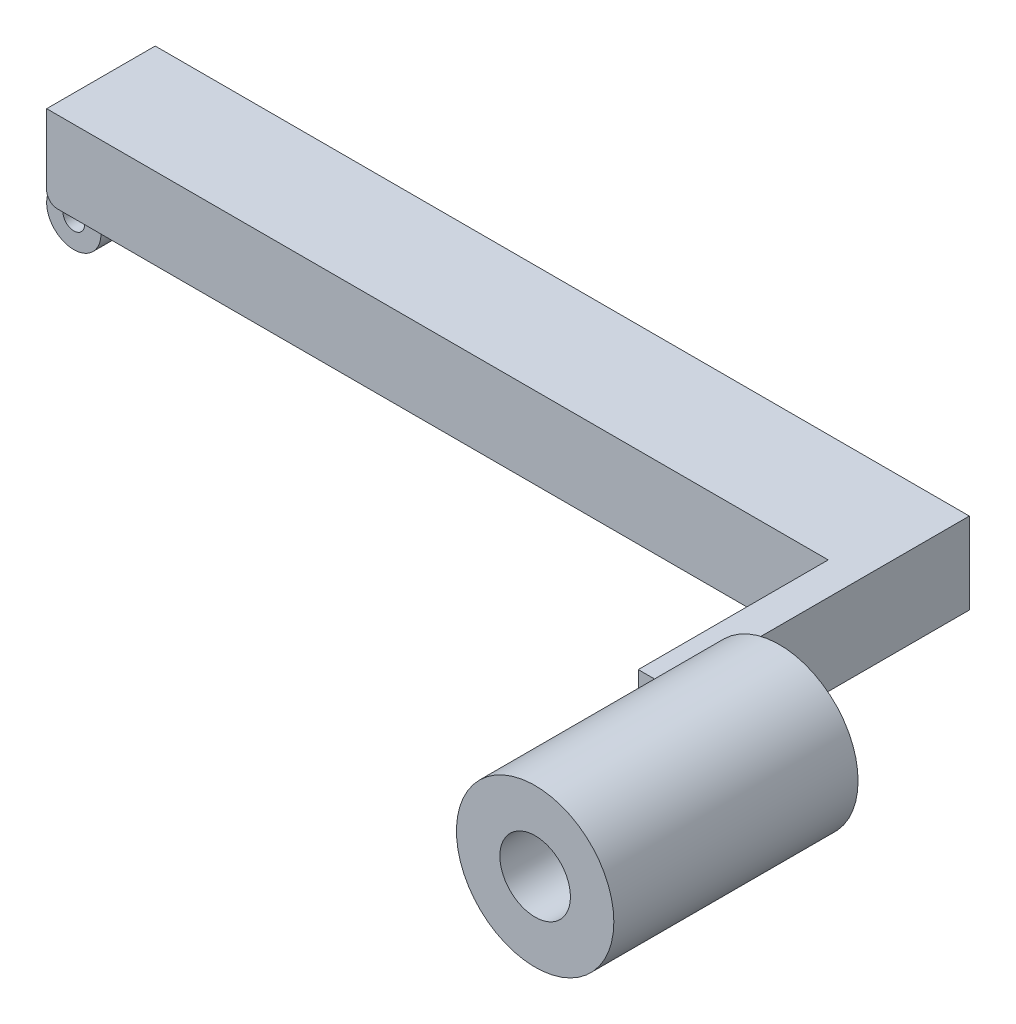
ISO-10303-21;
HEADER;
FILE_DESCRIPTION(('STEP AP214'),'2;1');
FILE_NAME('part.step','',(''),(''),'','','');
FILE_SCHEMA(('AUTOMOTIVE_DESIGN { 1 0 10303 214 1 1 1 1 }'));
ENDSEC;
DATA;
#1=APPLICATION_CONTEXT('core data for automotive mechanical design processes');
#2=APPLICATION_PROTOCOL_DEFINITION('international standard','automotive_design',2000,#1);
#3=PRODUCT_CONTEXT('',#1,'mechanical');
#4=PRODUCT('Part','Part','',(#3));
#5=PRODUCT_RELATED_PRODUCT_CATEGORY('part','',(#4));
#6=PRODUCT_DEFINITION_FORMATION('','',#4);
#7=PRODUCT_DEFINITION_CONTEXT('part definition',#1,'design');
#8=PRODUCT_DEFINITION('design','',#6,#7);
#9=PRODUCT_DEFINITION_SHAPE('','',#8);
#10=(LENGTH_UNIT() NAMED_UNIT(*) SI_UNIT(.MILLI.,.METRE.));
#11=(NAMED_UNIT(*) PLANE_ANGLE_UNIT() SI_UNIT($,.RADIAN.));
#12=(NAMED_UNIT(*) SI_UNIT($,.STERADIAN.) SOLID_ANGLE_UNIT());
#13=UNCERTAINTY_MEASURE_WITH_UNIT(LENGTH_MEASURE(1.E-05),#10,'distance_accuracy_value','');
#14=(GEOMETRIC_REPRESENTATION_CONTEXT(3) GLOBAL_UNCERTAINTY_ASSIGNED_CONTEXT((#13)) GLOBAL_UNIT_ASSIGNED_CONTEXT((#10,
#11,#12)) REPRESENTATION_CONTEXT('',''));
#15=CARTESIAN_POINT('',(0.,0.,0.));
#16=DIRECTION('',(0.,0.,1.));
#17=DIRECTION('',(1.,0.,0.));
#18=AXIS2_PLACEMENT_3D('',#15,#16,#17);
#19=CARTESIAN_POINT('',(150.,7.5,10.));
#20=DIRECTION('',(0.,-1.,0.));
#21=DIRECTION('',(0.,0.,-1.));
#22=AXIS2_PLACEMENT_3D('',#19,#20,#21);
#23=PLANE('',#22);
#24=DIRECTION('',(0.,0.,-1.));
#25=VECTOR('',#24,1.);
#26=CARTESIAN_POINT('',(147.590326354009,7.5,80.));
#27=LINE('',#26,#25);
#28=CARTESIAN_POINT('',(147.590326354009,7.5,35.));
#29=VERTEX_POINT('',#28);
#30=CARTESIAN_POINT('',(147.590326354009,7.5,45.));
#31=VERTEX_POINT('',#30);
#32=EDGE_CURVE('E179',#29,#31,#27,.F.);
#33=ORIENTED_EDGE('',*,*,#32,.F.);
#34=DIRECTION('',(-1.,0.,0.));
#35=VECTOR('',#34,1.);
#36=CARTESIAN_POINT('',(150.,7.5,35.));
#37=LINE('',#36,#35);
#38=CARTESIAN_POINT('',(150.,7.5,35.));
#39=VERTEX_POINT('',#38);
#40=EDGE_CURVE('E185',#39,#29,#37,.T.);
#41=ORIENTED_EDGE('',*,*,#40,.F.);
#42=DIRECTION('',(0.,0.,1.));
#43=VECTOR('',#42,1.);
#44=CARTESIAN_POINT('',(150.,7.5,10.));
#45=LINE('',#44,#43);
#46=CARTESIAN_POINT('',(150.,7.5,-10.));
#47=VERTEX_POINT('',#46);
#48=EDGE_CURVE('E207',#47,#39,#45,.T.);
#49=ORIENTED_EDGE('',*,*,#48,.F.);
#50=DIRECTION('',(-1.,0.,0.));
#51=VECTOR('',#50,1.);
#52=CARTESIAN_POINT('',(150.,7.5,-10.));
#53=LINE('',#52,#51);
#54=CARTESIAN_POINT('',(0.,7.5,-10.));
#55=VERTEX_POINT('',#54);
#56=EDGE_CURVE('E227',#47,#55,#53,.T.);
#57=ORIENTED_EDGE('',*,*,#56,.T.);
#58=DIRECTION('',(0.,0.,1.));
#59=VECTOR('',#58,1.);
#60=CARTESIAN_POINT('',(0.,7.5,10.));
#61=LINE('',#60,#59);
#62=CARTESIAN_POINT('',(0.,7.5,10.));
#63=VERTEX_POINT('',#62);
#64=EDGE_CURVE('E215',#55,#63,#61,.T.);
#65=ORIENTED_EDGE('',*,*,#64,.T.);
#66=DIRECTION('',(-1.,0.,0.));
#67=VECTOR('',#66,1.);
#68=CARTESIAN_POINT('',(150.,7.5,10.));
#69=LINE('',#68,#67);
#70=CARTESIAN_POINT('',(144.,7.5,10.));
#71=VERTEX_POINT('',#70);
#72=EDGE_CURVE('E225',#71,#63,#69,.T.);
#73=ORIENTED_EDGE('',*,*,#72,.F.);
#74=DIRECTION('',(0.,0.,-1.));
#75=VECTOR('',#74,1.);
#76=CARTESIAN_POINT('',(144.,7.5,45.));
#77=LINE('',#76,#75);
#78=CARTESIAN_POINT('',(144.,7.5,45.));
#79=VERTEX_POINT('',#78);
#80=EDGE_CURVE('E200',#79,#71,#77,.T.);
#81=ORIENTED_EDGE('',*,*,#80,.F.);
#82=DIRECTION('',(-1.,0.,0.));
#83=VECTOR('',#82,1.);
#84=CARTESIAN_POINT('',(150.,7.5,45.));
#85=LINE('',#84,#83);
#86=EDGE_CURVE('E189',#31,#79,#85,.T.);
#87=ORIENTED_EDGE('',*,*,#86,.F.);
#88=EDGE_LOOP('',(#33,#41,#49,#57,#65,#73,#81,#87));
#89=FACE_BOUND('',#88,.T.);
#90=ADVANCED_FACE('F37',(#89),#23,.F.);
#91=CARTESIAN_POINT('',(150.,-7.5,10.));
#92=DIRECTION('',(0.,1.,0.));
#93=DIRECTION('',(0.,0.,1.));
#94=AXIS2_PLACEMENT_3D('',#91,#92,#93);
#95=PLANE('',#94);
#96=DIRECTION('',(-1.,0.,0.));
#97=VECTOR('',#96,1.);
#98=CARTESIAN_POINT('',(0.,-7.5,-5.));
#99=LINE('',#98,#97);
#100=CARTESIAN_POINT('',(5.,-7.5,-5.));
#101=VERTEX_POINT('',#100);
#102=CARTESIAN_POINT('',(2.,-7.5,-5.));
#103=VERTEX_POINT('',#102);
#104=EDGE_CURVE('E155',#101,#103,#99,.T.);
#105=ORIENTED_EDGE('',*,*,#104,.T.);
#106=DIRECTION('',(0.,0.,-1.));
#107=VECTOR('',#106,1.);
#108=CARTESIAN_POINT('',(2.,-7.5,-10.));
#109=LINE('',#108,#107);
#110=CARTESIAN_POINT('',(2.,-7.5,-10.));
#111=VERTEX_POINT('',#110);
#112=EDGE_CURVE('E239',#103,#111,#109,.T.);
#113=ORIENTED_EDGE('',*,*,#112,.T.);
#114=DIRECTION('',(-1.,0.,0.));
#115=VECTOR('',#114,1.);
#116=CARTESIAN_POINT('',(150.,-7.5,-10.));
#117=LINE('',#116,#115);
#118=CARTESIAN_POINT('',(150.,-7.5,-10.));
#119=VERTEX_POINT('',#118);
#120=EDGE_CURVE('E213',#119,#111,#117,.T.);
#121=ORIENTED_EDGE('',*,*,#120,.F.);
#122=DIRECTION('',(0.,0.,-1.));
#123=VECTOR('',#122,1.);
#124=CARTESIAN_POINT('',(150.,-7.5,10.));
#125=LINE('',#124,#123);
#126=CARTESIAN_POINT('',(150.,-7.5,35.));
#127=VERTEX_POINT('',#126);
#128=EDGE_CURVE('E211',#127,#119,#125,.T.);
#129=ORIENTED_EDGE('',*,*,#128,.F.);
#130=DIRECTION('',(1.,0.,0.));
#131=VECTOR('',#130,1.);
#132=CARTESIAN_POINT('',(150.,-7.5,35.));
#133=LINE('',#132,#131);
#134=CARTESIAN_POINT('',(147.590326354009,-7.5,35.));
#135=VERTEX_POINT('',#134);
#136=EDGE_CURVE('E182',#135,#127,#133,.T.);
#137=ORIENTED_EDGE('',*,*,#136,.F.);
#138=DIRECTION('',(0.,0.,-1.));
#139=VECTOR('',#138,1.);
#140=CARTESIAN_POINT('',(147.590326354009,-7.5,80.));
#141=LINE('',#140,#139);
#142=CARTESIAN_POINT('',(147.590326354009,-7.5,45.));
#143=VERTEX_POINT('',#142);
#144=EDGE_CURVE('E176',#143,#135,#141,.T.);
#145=ORIENTED_EDGE('',*,*,#144,.F.);
#146=DIRECTION('',(1.,0.,0.));
#147=VECTOR('',#146,1.);
#148=CARTESIAN_POINT('',(150.,-7.5,45.));
#149=LINE('',#148,#147);
#150=CARTESIAN_POINT('',(144.,-7.5,45.));
#151=VERTEX_POINT('',#150);
#152=EDGE_CURVE('E193',#151,#143,#149,.T.);
#153=ORIENTED_EDGE('',*,*,#152,.F.);
#154=DIRECTION('',(0.,0.,-1.));
#155=VECTOR('',#154,1.);
#156=CARTESIAN_POINT('',(144.,-7.5,45.));
#157=LINE('',#156,#155);
#158=CARTESIAN_POINT('',(144.,-7.5,10.));
#159=VERTEX_POINT('',#158);
#160=EDGE_CURVE('E195',#151,#159,#157,.T.);
#161=ORIENTED_EDGE('',*,*,#160,.T.);
#162=DIRECTION('',(-1.,0.,0.));
#163=VECTOR('',#162,1.);
#164=CARTESIAN_POINT('',(150.,-7.5,10.));
#165=LINE('',#164,#163);
#166=CARTESIAN_POINT('',(2.,-7.5,10.));
#167=VERTEX_POINT('',#166);
#168=EDGE_CURVE('E222',#159,#167,#165,.T.);
#169=ORIENTED_EDGE('',*,*,#168,.T.);
#170=DIRECTION('',(0.,0.,-1.));
#171=VECTOR('',#170,1.);
#172=CARTESIAN_POINT('',(2.,-7.5,5.));
#173=LINE('',#172,#171);
#174=CARTESIAN_POINT('',(2.,-7.5,5.));
#175=VERTEX_POINT('',#174);
#176=EDGE_CURVE('E236',#167,#175,#173,.T.);
#177=ORIENTED_EDGE('',*,*,#176,.T.);
#178=DIRECTION('',(-1.,0.,0.));
#179=VECTOR('',#178,1.);
#180=CARTESIAN_POINT('',(0.,-7.5,5.));
#181=LINE('',#180,#179);
#182=CARTESIAN_POINT('',(5.,-7.5,5.));
#183=VERTEX_POINT('',#182);
#184=EDGE_CURVE('E147',#183,#175,#181,.T.);
#185=ORIENTED_EDGE('',*,*,#184,.F.);
#186=DIRECTION('',(0.,0.,-1.));
#187=VECTOR('',#186,1.);
#188=CARTESIAN_POINT('',(5.,-7.5,5.));
#189=LINE('',#188,#187);
#190=EDGE_CURVE('E145',#183,#101,#189,.T.);
#191=ORIENTED_EDGE('',*,*,#190,.T.);
#192=EDGE_LOOP('',(#105,#113,#121,#129,#137,#145,#153,#161,#169,#177,#185,#191));
#193=FACE_BOUND('',#192,.T.);
#194=ADVANCED_FACE('F260',(#193),#95,.F.);
#195=CARTESIAN_POINT('',(150.,0.,0.));
#196=DIRECTION('',(-1.,0.,0.));
#197=DIRECTION('',(0.,0.,1.));
#198=AXIS2_PLACEMENT_3D('',#195,#196,#197);
#199=PLANE('',#198);
#200=DIRECTION('',(0.,1.,0.));
#201=VECTOR('',#200,1.);
#202=CARTESIAN_POINT('',(150.,0.,35.));
#203=LINE('',#202,#201);
#204=EDGE_CURVE('E233',#127,#39,#203,.T.);
#205=ORIENTED_EDGE('',*,*,#204,.F.);
#206=ORIENTED_EDGE('',*,*,#128,.T.);
#207=DIRECTION('',(0.,1.,0.));
#208=VECTOR('',#207,1.);
#209=CARTESIAN_POINT('',(150.,-7.5,-10.));
#210=LINE('',#209,#208);
#211=EDGE_CURVE('E204',#119,#47,#210,.T.);
#212=ORIENTED_EDGE('',*,*,#211,.T.);
#213=ORIENTED_EDGE('',*,*,#48,.T.);
#214=EDGE_LOOP('',(#205,#206,#212,#213));
#215=FACE_BOUND('',#214,.T.);
#216=ADVANCED_FACE('F277',(#215),#199,.F.);
#217=CARTESIAN_POINT('',(150.,-7.5,10.));
#218=DIRECTION('',(0.,0.,-1.));
#219=DIRECTION('',(-1.,0.,0.));
#220=AXIS2_PLACEMENT_3D('',#217,#218,#219);
#221=PLANE('',#220);
#222=DIRECTION('',(0.,-1.,0.));
#223=VECTOR('',#222,1.);
#224=CARTESIAN_POINT('',(0.,-7.5,10.));
#225=LINE('',#224,#223);
#226=CARTESIAN_POINT('',(0.,-5.5,10.));
#227=VERTEX_POINT('',#226);
#228=EDGE_CURVE('E208',#63,#227,#225,.T.);
#229=ORIENTED_EDGE('',*,*,#228,.T.);
#230=CARTESIAN_POINT('',(2.,-5.5,10.));
#231=DIRECTION('',(0.,0.,-1.));
#232=DIRECTION('',(-1.,0.,0.));
#233=AXIS2_PLACEMENT_3D('',#230,#231,#232);
#234=CIRCLE('',#233,2.);
#235=EDGE_CURVE('E250',#227,#167,#234,.F.);
#236=ORIENTED_EDGE('',*,*,#235,.T.);
#237=ORIENTED_EDGE('',*,*,#168,.F.);
#238=DIRECTION('',(0.,-1.,0.));
#239=VECTOR('',#238,1.);
#240=CARTESIAN_POINT('',(144.,7.5,10.));
#241=LINE('',#240,#239);
#242=EDGE_CURVE('E188',#71,#159,#241,.T.);
#243=ORIENTED_EDGE('',*,*,#242,.F.);
#244=ORIENTED_EDGE('',*,*,#72,.T.);
#245=EDGE_LOOP('',(#229,#236,#237,#243,#244));
#246=FACE_BOUND('',#245,.T.);
#247=ADVANCED_FACE('F295',(#246),#221,.F.);
#248=CARTESIAN_POINT('',(150.,-7.5,-10.));
#249=DIRECTION('',(0.,0.,1.));
#250=DIRECTION('',(1.,0.,0.));
#251=AXIS2_PLACEMENT_3D('',#248,#249,#250);
#252=PLANE('',#251);
#253=ORIENTED_EDGE('',*,*,#120,.T.);
#254=CARTESIAN_POINT('',(2.,-5.5,-10.));
#255=DIRECTION('',(0.,0.,1.));
#256=DIRECTION('',(1.,0.,0.));
#257=AXIS2_PLACEMENT_3D('',#254,#255,#256);
#258=CIRCLE('',#257,2.);
#259=CARTESIAN_POINT('',(0.,-5.5,-10.));
#260=VERTEX_POINT('',#259);
#261=EDGE_CURVE('E242',#111,#260,#258,.F.);
#262=ORIENTED_EDGE('',*,*,#261,.T.);
#263=DIRECTION('',(0.,1.,0.));
#264=VECTOR('',#263,1.);
#265=CARTESIAN_POINT('',(0.,-7.5,-10.));
#266=LINE('',#265,#264);
#267=EDGE_CURVE('E203',#260,#55,#266,.T.);
#268=ORIENTED_EDGE('',*,*,#267,.T.);
#269=ORIENTED_EDGE('',*,*,#56,.F.);
#270=ORIENTED_EDGE('',*,*,#211,.F.);
#271=EDGE_LOOP('',(#253,#262,#268,#269,#270));
#272=FACE_BOUND('',#271,.T.);
#273=ADVANCED_FACE('F267',(#272),#252,.F.);
#274=CARTESIAN_POINT('',(0.,0.,0.));
#275=DIRECTION('',(-1.,0.,0.));
#276=DIRECTION('',(0.,0.,1.));
#277=AXIS2_PLACEMENT_3D('',#274,#275,#276);
#278=PLANE('',#277);
#279=ORIENTED_EDGE('',*,*,#267,.F.);
#280=DIRECTION('',(0.,0.,-1.));
#281=VECTOR('',#280,1.);
#282=CARTESIAN_POINT('',(0.,-5.5,-5.));
#283=LINE('',#282,#281);
#284=CARTESIAN_POINT('',(0.,-5.5,-5.));
#285=VERTEX_POINT('',#284);
#286=EDGE_CURVE('E248',#260,#285,#283,.F.);
#287=ORIENTED_EDGE('',*,*,#286,.T.);
#288=DIRECTION('',(0.,-1.,0.));
#289=VECTOR('',#288,1.);
#290=CARTESIAN_POINT('',(0.,-12.5,-5.));
#291=LINE('',#290,#289);
#292=CARTESIAN_POINT('',(0.,-7.5,-5.));
#293=VERTEX_POINT('',#292);
#294=EDGE_CURVE('E59',#285,#293,#291,.T.);
#295=ORIENTED_EDGE('',*,*,#294,.T.);
#296=DIRECTION('',(0.,0.,-1.));
#297=VECTOR('',#296,1.);
#298=CARTESIAN_POINT('',(0.,-7.5,5.));
#299=LINE('',#298,#297);
#300=CARTESIAN_POINT('',(0.,-7.5,5.));
#301=VERTEX_POINT('',#300);
#302=EDGE_CURVE('E164',#301,#293,#299,.T.);
#303=ORIENTED_EDGE('',*,*,#302,.F.);
#304=DIRECTION('',(0.,1.,0.));
#305=VECTOR('',#304,1.);
#306=CARTESIAN_POINT('',(0.,0.,5.));
#307=LINE('',#306,#305);
#308=CARTESIAN_POINT('',(0.,-5.5,5.));
#309=VERTEX_POINT('',#308);
#310=EDGE_CURVE('E51',#301,#309,#307,.T.);
#311=ORIENTED_EDGE('',*,*,#310,.T.);
#312=DIRECTION('',(0.,0.,-1.));
#313=VECTOR('',#312,1.);
#314=CARTESIAN_POINT('',(0.,-5.5,10.));
#315=LINE('',#314,#313);
#316=EDGE_CURVE('E244',#309,#227,#315,.F.);
#317=ORIENTED_EDGE('',*,*,#316,.T.);
#318=ORIENTED_EDGE('',*,*,#228,.F.);
#319=ORIENTED_EDGE('',*,*,#64,.F.);
#320=EDGE_LOOP('',(#279,#287,#295,#303,#311,#317,#318,#319));
#321=FACE_BOUND('',#320,.T.);
#322=ADVANCED_FACE('F272',(#321),#278,.T.);
#323=CARTESIAN_POINT('',(144.,7.5,45.));
#324=DIRECTION('',(1.,0.,0.));
#325=DIRECTION('',(0.,0.,-1.));
#326=AXIS2_PLACEMENT_3D('',#323,#324,#325);
#327=PLANE('',#326);
#328=ORIENTED_EDGE('',*,*,#242,.T.);
#329=ORIENTED_EDGE('',*,*,#160,.F.);
#330=DIRECTION('',(0.,-1.,0.));
#331=VECTOR('',#330,1.);
#332=CARTESIAN_POINT('',(144.,7.5,45.));
#333=LINE('',#332,#331);
#334=EDGE_CURVE('E191',#79,#151,#333,.T.);
#335=ORIENTED_EDGE('',*,*,#334,.F.);
#336=ORIENTED_EDGE('',*,*,#80,.T.);
#337=EDGE_LOOP('',(#328,#329,#335,#336));
#338=FACE_BOUND('',#337,.T.);
#339=ADVANCED_FACE('F293',(#338),#327,.F.);
#340=CARTESIAN_POINT('',(0.,0.,45.));
#341=DIRECTION('',(0.,0.,-1.));
#342=DIRECTION('',(-1.,0.,0.));
#343=AXIS2_PLACEMENT_3D('',#340,#341,#342);
#344=PLANE('',#343);
#345=CARTESIAN_POINT('',(160.,0.,45.));
#346=DIRECTION('',(0.,0.,-1.));
#347=DIRECTION('',(-1.,0.,0.));
#348=AXIS2_PLACEMENT_3D('',#345,#346,#347);
#349=CIRCLE('',#348,14.5);
#350=EDGE_CURVE('E230',#31,#143,#349,.F.);
#351=ORIENTED_EDGE('',*,*,#350,.F.);
#352=ORIENTED_EDGE('',*,*,#86,.T.);
#353=ORIENTED_EDGE('',*,*,#334,.T.);
#354=ORIENTED_EDGE('',*,*,#152,.T.);
#355=EDGE_LOOP('',(#351,#352,#353,#354));
#356=FACE_BOUND('',#355,.T.);
#357=ADVANCED_FACE('F288',(#356),#344,.F.);
#358=CARTESIAN_POINT('',(160.,0.,35.));
#359=DIRECTION('',(0.,0.,1.));
#360=DIRECTION('',(1.,0.,0.));
#361=AXIS2_PLACEMENT_3D('',#358,#359,#360);
#362=PLANE('',#361);
#363=CARTESIAN_POINT('',(160.,0.,35.));
#364=DIRECTION('',(0.,0.,1.));
#365=DIRECTION('',(1.,0.,0.));
#366=AXIS2_PLACEMENT_3D('',#363,#364,#365);
#367=CIRCLE('',#366,6.50000000000002);
#368=CARTESIAN_POINT('',(166.5,0.,35.));
#369=VERTEX_POINT('',#368);
#370=EDGE_CURVE('E159',#369,#369,#367,.T.);
#371=ORIENTED_EDGE('',*,*,#370,.T.);
#372=EDGE_LOOP('',(#371));
#373=FACE_BOUND('',#372,.T.);
#374=ORIENTED_EDGE('',*,*,#204,.T.);
#375=ORIENTED_EDGE('',*,*,#40,.T.);
#376=CARTESIAN_POINT('',(160.,0.,35.));
#377=DIRECTION('',(0.,0.,1.));
#378=DIRECTION('',(1.,0.,0.));
#379=AXIS2_PLACEMENT_3D('',#376,#377,#378);
#380=CIRCLE('',#379,14.5);
#381=EDGE_CURVE('E162',#135,#29,#380,.T.);
#382=ORIENTED_EDGE('',*,*,#381,.F.);
#383=ORIENTED_EDGE('',*,*,#136,.T.);
#384=EDGE_LOOP('',(#374,#375,#382,#383));
#385=FACE_BOUND('',#384,.T.);
#386=ADVANCED_FACE('F282',(#373,#385),#362,.F.);
#387=CARTESIAN_POINT('',(160.,0.,80.));
#388=DIRECTION('',(0.,0.,-1.));
#389=DIRECTION('',(-1.,0.,0.));
#390=AXIS2_PLACEMENT_3D('',#387,#388,#389);
#391=CYLINDRICAL_SURFACE('',#390,14.5);
#392=CARTESIAN_POINT('',(160.,0.,80.));
#393=DIRECTION('',(0.,0.,1.));
#394=DIRECTION('',(1.,0.,0.));
#395=AXIS2_PLACEMENT_3D('',#392,#393,#394);
#396=CIRCLE('',#395,14.5);
#397=CARTESIAN_POINT('',(174.5,0.,80.));
#398=VERTEX_POINT('',#397);
#399=EDGE_CURVE('E173',#398,#398,#396,.T.);
#400=ORIENTED_EDGE('',*,*,#399,.F.);
#401=EDGE_LOOP('',(#400));
#402=FACE_BOUND('',#401,.T.);
#403=ORIENTED_EDGE('',*,*,#381,.T.);
#404=ORIENTED_EDGE('',*,*,#32,.T.);
#405=ORIENTED_EDGE('',*,*,#350,.T.);
#406=ORIENTED_EDGE('',*,*,#144,.T.);
#407=EDGE_LOOP('',(#403,#404,#405,#406));
#408=FACE_BOUND('',#407,.T.);
#409=ADVANCED_FACE('F284',(#402,#408),#391,.T.);
#410=CARTESIAN_POINT('',(160.,0.,80.));
#411=DIRECTION('',(0.,0.,1.));
#412=DIRECTION('',(1.,0.,0.));
#413=AXIS2_PLACEMENT_3D('',#410,#411,#412);
#414=PLANE('',#413);
#415=ORIENTED_EDGE('',*,*,#399,.T.);
#416=EDGE_LOOP('',(#415));
#417=FACE_BOUND('',#416,.T.);
#418=CARTESIAN_POINT('',(160.,0.,80.));
#419=DIRECTION('',(0.,0.,1.));
#420=DIRECTION('',(1.,0.,0.));
#421=AXIS2_PLACEMENT_3D('',#418,#419,#420);
#422=CIRCLE('',#421,6.50000000000002);
#423=CARTESIAN_POINT('',(166.5,0.,80.));
#424=VERTEX_POINT('',#423);
#425=EDGE_CURVE('E170',#424,#424,#422,.T.);
#426=ORIENTED_EDGE('',*,*,#425,.F.);
#427=EDGE_LOOP('',(#426));
#428=FACE_BOUND('',#427,.T.);
#429=ADVANCED_FACE('F322',(#417,#428),#414,.T.);
#430=CARTESIAN_POINT('',(160.,0.,80.));
#431=DIRECTION('',(0.,0.,-1.));
#432=DIRECTION('',(-1.,0.,0.));
#433=AXIS2_PLACEMENT_3D('',#430,#431,#432);
#434=CYLINDRICAL_SURFACE('',#433,6.50000000000002);
#435=ORIENTED_EDGE('',*,*,#425,.T.);
#436=EDGE_LOOP('',(#435));
#437=FACE_BOUND('',#436,.T.);
#438=ORIENTED_EDGE('',*,*,#370,.F.);
#439=EDGE_LOOP('',(#438));
#440=FACE_BOUND('',#439,.T.);
#441=ADVANCED_FACE('F314',(#437,#440),#434,.F.);
#442=CARTESIAN_POINT('',(0.,-12.5,5.));
#443=DIRECTION('',(0.,0.,1.));
#444=DIRECTION('',(1.,0.,0.));
#445=AXIS2_PLACEMENT_3D('',#442,#443,#444);
#446=PLANE('',#445);
#447=CARTESIAN_POINT('',(0.,-12.5,5.));
#448=DIRECTION('',(0.,0.,1.));
#449=DIRECTION('',(1.,0.,0.));
#450=AXIS2_PLACEMENT_3D('',#447,#448,#449);
#451=CIRCLE('',#450,5.);
#452=CARTESIAN_POINT('',(5.,-12.5,5.));
#453=VERTEX_POINT('',#452);
#454=EDGE_CURVE('E148',#301,#453,#451,.T.);
#455=ORIENTED_EDGE('',*,*,#454,.T.);
#456=DIRECTION('',(0.,1.,0.));
#457=VECTOR('',#456,1.);
#458=CARTESIAN_POINT('',(5.,-12.5,5.));
#459=LINE('',#458,#457);
#460=EDGE_CURVE('E139',#453,#183,#459,.T.);
#461=ORIENTED_EDGE('',*,*,#460,.T.);
#462=ORIENTED_EDGE('',*,*,#184,.T.);
#463=CARTESIAN_POINT('',(2.,-5.5,5.));
#464=DIRECTION('',(0.,0.,1.));
#465=DIRECTION('',(1.,0.,0.));
#466=AXIS2_PLACEMENT_3D('',#463,#464,#465);
#467=CIRCLE('',#466,2.);
#468=EDGE_CURVE('E11',#175,#309,#467,.F.);
#469=ORIENTED_EDGE('',*,*,#468,.T.);
#470=ORIENTED_EDGE('',*,*,#310,.F.);
#471=EDGE_LOOP('',(#455,#461,#462,#469,#470));
#472=FACE_BOUND('',#471,.T.);
#473=CARTESIAN_POINT('',(0.,-12.5,5.));
#474=DIRECTION('',(0.,0.,1.));
#475=DIRECTION('',(1.,0.,0.));
#476=AXIS2_PLACEMENT_3D('',#473,#474,#475);
#477=CIRCLE('',#476,2.);
#478=CARTESIAN_POINT('',(2.,-12.5,5.));
#479=VERTEX_POINT('',#478);
#480=EDGE_CURVE('E303',#479,#479,#477,.T.);
#481=ORIENTED_EDGE('',*,*,#480,.F.);
#482=EDGE_LOOP('',(#481));
#483=FACE_BOUND('',#482,.T.);
#484=ADVANCED_FACE('F151',(#472,#483),#446,.T.);
#485=CARTESIAN_POINT('',(0.,-12.5,-5.));
#486=DIRECTION('',(0.,0.,1.));
#487=DIRECTION('',(1.,0.,0.));
#488=AXIS2_PLACEMENT_3D('',#485,#486,#487);
#489=PLANE('',#488);
#490=CARTESIAN_POINT('',(0.,-12.5,-5.));
#491=DIRECTION('',(0.,0.,1.));
#492=DIRECTION('',(1.,0.,0.));
#493=AXIS2_PLACEMENT_3D('',#490,#491,#492);
#494=CIRCLE('',#493,5.);
#495=CARTESIAN_POINT('',(5.,-12.5,-5.));
#496=VERTEX_POINT('',#495);
#497=EDGE_CURVE('E158',#293,#496,#494,.T.);
#498=ORIENTED_EDGE('',*,*,#497,.F.);
#499=ORIENTED_EDGE('',*,*,#294,.F.);
#500=CARTESIAN_POINT('',(2.,-5.5,-5.));
#501=DIRECTION('',(0.,0.,1.));
#502=DIRECTION('',(1.,0.,0.));
#503=AXIS2_PLACEMENT_3D('',#500,#501,#502);
#504=CIRCLE('',#503,2.);
#505=EDGE_CURVE('E45',#285,#103,#504,.T.);
#506=ORIENTED_EDGE('',*,*,#505,.T.);
#507=ORIENTED_EDGE('',*,*,#104,.F.);
#508=DIRECTION('',(0.,1.,0.));
#509=VECTOR('',#508,1.);
#510=CARTESIAN_POINT('',(5.,-12.5,-5.));
#511=LINE('',#510,#509);
#512=EDGE_CURVE('E262',#496,#101,#511,.T.);
#513=ORIENTED_EDGE('',*,*,#512,.F.);
#514=EDGE_LOOP('',(#498,#499,#506,#507,#513));
#515=FACE_BOUND('',#514,.T.);
#516=CARTESIAN_POINT('',(0.,-12.5,-5.));
#517=DIRECTION('',(0.,0.,1.));
#518=DIRECTION('',(1.,0.,0.));
#519=AXIS2_PLACEMENT_3D('',#516,#517,#518);
#520=CIRCLE('',#519,2.);
#521=CARTESIAN_POINT('',(2.,-12.5,-5.));
#522=VERTEX_POINT('',#521);
#523=EDGE_CURVE('E305',#522,#522,#520,.T.);
#524=ORIENTED_EDGE('',*,*,#523,.T.);
#525=EDGE_LOOP('',(#524));
#526=FACE_BOUND('',#525,.T.);
#527=ADVANCED_FACE('F254',(#515,#526),#489,.F.);
#528=CARTESIAN_POINT('',(0.,-12.5,5.));
#529=DIRECTION('',(0.,0.,-1.));
#530=DIRECTION('',(-1.,0.,0.));
#531=AXIS2_PLACEMENT_3D('',#528,#529,#530);
#532=CYLINDRICAL_SURFACE('',#531,5.);
#533=ORIENTED_EDGE('',*,*,#497,.T.);
#534=DIRECTION('',(0.,0.,-1.));
#535=VECTOR('',#534,1.);
#536=CARTESIAN_POINT('',(5.,-12.5,5.));
#537=LINE('',#536,#535);
#538=EDGE_CURVE('E143',#453,#496,#537,.T.);
#539=ORIENTED_EDGE('',*,*,#538,.F.);
#540=ORIENTED_EDGE('',*,*,#454,.F.);
#541=ORIENTED_EDGE('',*,*,#302,.T.);
#542=EDGE_LOOP('',(#533,#539,#540,#541));
#543=FACE_BOUND('',#542,.T.);
#544=ADVANCED_FACE('F157',(#543),#532,.T.);
#545=CARTESIAN_POINT('',(5.,-12.5,5.));
#546=DIRECTION('',(-1.,0.,0.));
#547=DIRECTION('',(0.,-1.,0.));
#548=AXIS2_PLACEMENT_3D('',#545,#546,#547);
#549=PLANE('',#548);
#550=ORIENTED_EDGE('',*,*,#512,.T.);
#551=ORIENTED_EDGE('',*,*,#190,.F.);
#552=ORIENTED_EDGE('',*,*,#460,.F.);
#553=ORIENTED_EDGE('',*,*,#538,.T.);
#554=EDGE_LOOP('',(#550,#551,#552,#553));
#555=FACE_BOUND('',#554,.T.);
#556=ADVANCED_FACE('F141',(#555),#549,.F.);
#557=CARTESIAN_POINT('',(0.,-12.5,5.));
#558=DIRECTION('',(0.,0.,-1.));
#559=DIRECTION('',(-1.,0.,0.));
#560=AXIS2_PLACEMENT_3D('',#557,#558,#559);
#561=CYLINDRICAL_SURFACE('',#560,2.);
#562=ORIENTED_EDGE('',*,*,#480,.T.);
#563=EDGE_LOOP('',(#562));
#564=FACE_BOUND('',#563,.T.);
#565=ORIENTED_EDGE('',*,*,#523,.F.);
#566=EDGE_LOOP('',(#565));
#567=FACE_BOUND('',#566,.T.);
#568=ADVANCED_FACE('F311',(#564,#567),#561,.F.);
#569=CARTESIAN_POINT('',(2.,-5.5,10.));
#570=DIRECTION('',(0.,0.,1.));
#571=DIRECTION('',(1.,0.,0.));
#572=AXIS2_PLACEMENT_3D('',#569,#570,#571);
#573=CYLINDRICAL_SURFACE('',#572,2.);
#574=ORIENTED_EDGE('',*,*,#505,.F.);
#575=ORIENTED_EDGE('',*,*,#286,.F.);
#576=ORIENTED_EDGE('',*,*,#261,.F.);
#577=ORIENTED_EDGE('',*,*,#112,.F.);
#578=EDGE_LOOP('',(#574,#575,#576,#577));
#579=FACE_BOUND('',#578,.T.);
#580=ADVANCED_FACE('F264',(#579),#573,.T.);
#581=CARTESIAN_POINT('',(2.,-5.5,10.));
#582=DIRECTION('',(0.,0.,1.));
#583=DIRECTION('',(1.,0.,0.));
#584=AXIS2_PLACEMENT_3D('',#581,#582,#583);
#585=CYLINDRICAL_SURFACE('',#584,2.);
#586=ORIENTED_EDGE('',*,*,#235,.F.);
#587=ORIENTED_EDGE('',*,*,#316,.F.);
#588=ORIENTED_EDGE('',*,*,#468,.F.);
#589=ORIENTED_EDGE('',*,*,#176,.F.);
#590=EDGE_LOOP('',(#586,#587,#588,#589));
#591=FACE_BOUND('',#590,.T.);
#592=ADVANCED_FACE('F39',(#591),#585,.T.);
#593=CLOSED_SHELL('',(#90,#194,#216,#247,#273,#322,#339,#357,#386,#409,#429,#441,#484,#527,#544,
#556,#568,#580,#592));
#594=MANIFOLD_SOLID_BREP('B2',#593);
#595=ADVANCED_BREP_SHAPE_REPRESENTATION('',(#18,#594),#14);
#596=SHAPE_DEFINITION_REPRESENTATION(#9,#595);
ENDSEC;
END-ISO-10303-21;
